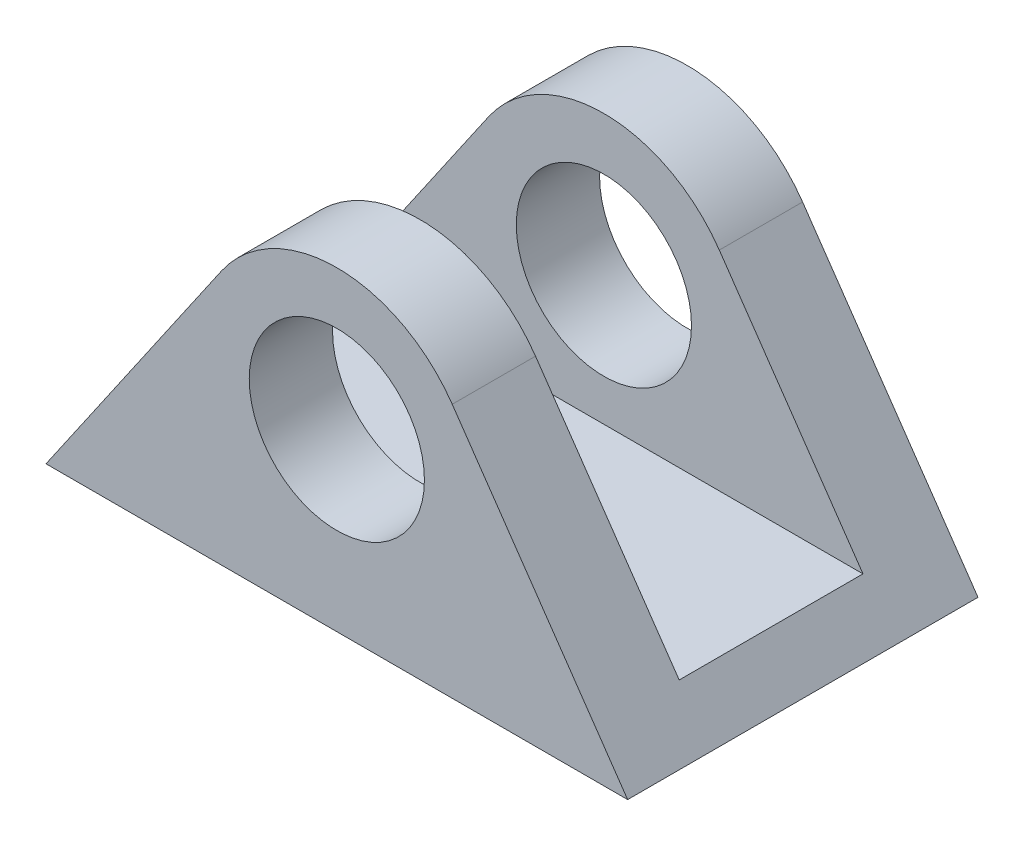
ISO-10303-21;
HEADER;
FILE_DESCRIPTION(('STEP AP214'),'2;1');
FILE_NAME('part.step','',(''),(''),'','','');
FILE_SCHEMA(('AUTOMOTIVE_DESIGN { 1 0 10303 214 1 1 1 1 }'));
ENDSEC;
DATA;
#1=APPLICATION_CONTEXT('core data for automotive mechanical design processes');
#2=APPLICATION_PROTOCOL_DEFINITION('international standard','automotive_design',2000,#1);
#3=PRODUCT_CONTEXT('',#1,'mechanical');
#4=PRODUCT('Part','Part','',(#3));
#5=PRODUCT_RELATED_PRODUCT_CATEGORY('part','',(#4));
#6=PRODUCT_DEFINITION_FORMATION('','',#4);
#7=PRODUCT_DEFINITION_CONTEXT('part definition',#1,'design');
#8=PRODUCT_DEFINITION('design','',#6,#7);
#9=PRODUCT_DEFINITION_SHAPE('','',#8);
#10=(LENGTH_UNIT() NAMED_UNIT(*) SI_UNIT(.MILLI.,.METRE.));
#11=(NAMED_UNIT(*) PLANE_ANGLE_UNIT() SI_UNIT($,.RADIAN.));
#12=(NAMED_UNIT(*) SI_UNIT($,.STERADIAN.) SOLID_ANGLE_UNIT());
#13=UNCERTAINTY_MEASURE_WITH_UNIT(LENGTH_MEASURE(1.E-05),#10,'distance_accuracy_value','');
#14=(GEOMETRIC_REPRESENTATION_CONTEXT(3) GLOBAL_UNCERTAINTY_ASSIGNED_CONTEXT((#13)) GLOBAL_UNIT_ASSIGNED_CONTEXT((#10,
#11,#12)) REPRESENTATION_CONTEXT('',''));
#15=CARTESIAN_POINT('',(0.,0.,0.));
#16=DIRECTION('',(0.,0.,1.));
#17=DIRECTION('',(1.,0.,0.));
#18=AXIS2_PLACEMENT_3D('',#15,#16,#17);
#19=CARTESIAN_POINT('',(0.,0.,20.));
#20=DIRECTION('',(0.,0.,-1.));
#21=DIRECTION('',(-1.,0.,0.));
#22=AXIS2_PLACEMENT_3D('',#19,#20,#21);
#23=CYLINDRICAL_SURFACE('',#22,8.);
#24=DIRECTION('',(0.,0.,-1.));
#25=VECTOR('',#24,1.);
#26=CARTESIAN_POINT('',(-6.58840470910797,4.5379426383554,20.));
#27=LINE('',#26,#25);
#28=CARTESIAN_POINT('',(-6.58840470910797,4.5379426383554,4.75433037321072));
#29=VERTEX_POINT('',#28);
#30=CARTESIAN_POINT('',(-6.58840470910797,4.5379426383554,0.));
#31=VERTEX_POINT('',#30);
#32=EDGE_CURVE('E155',#29,#31,#27,.T.);
#33=ORIENTED_EDGE('',*,*,#32,.F.);
#34=CARTESIAN_POINT('',(0.,0.,4.75433037321072));
#35=DIRECTION('',(0.,0.,-1.));
#36=DIRECTION('',(-1.,0.,0.));
#37=AXIS2_PLACEMENT_3D('',#34,#35,#36);
#38=CIRCLE('',#37,8.);
#39=CARTESIAN_POINT('',(6.58840470910797,4.5379426383554,4.75433037321072));
#40=VERTEX_POINT('',#39);
#41=EDGE_CURVE('E126',#29,#40,#38,.T.);
#42=ORIENTED_EDGE('',*,*,#41,.T.);
#43=DIRECTION('',(0.,0.,-1.));
#44=VECTOR('',#43,1.);
#45=CARTESIAN_POINT('',(6.58840470910797,4.5379426383554,20.));
#46=LINE('',#45,#44);
#47=CARTESIAN_POINT('',(6.58840470910797,4.5379426383554,0.));
#48=VERTEX_POINT('',#47);
#49=EDGE_CURVE('E159',#40,#48,#46,.T.);
#50=ORIENTED_EDGE('',*,*,#49,.T.);
#51=CARTESIAN_POINT('',(0.,0.,0.));
#52=DIRECTION('',(0.,0.,1.));
#53=DIRECTION('',(1.,0.,0.));
#54=AXIS2_PLACEMENT_3D('',#51,#52,#53);
#55=CIRCLE('',#54,8.);
#56=EDGE_CURVE('E124',#48,#31,#55,.T.);
#57=ORIENTED_EDGE('',*,*,#56,.T.);
#58=EDGE_LOOP('',(#33,#42,#50,#57));
#59=FACE_BOUND('',#58,.T.);
#60=ADVANCED_FACE('F34',(#59),#23,.T.);
#61=CARTESIAN_POINT('',(0.,0.,20.));
#62=DIRECTION('',(0.,0.,-1.));
#63=DIRECTION('',(-1.,0.,0.));
#64=AXIS2_PLACEMENT_3D('',#61,#62,#63);
#65=CYLINDRICAL_SURFACE('',#64,5.);
#66=CARTESIAN_POINT('',(0.,0.,4.75433037321072));
#67=DIRECTION('',(0.,0.,-1.));
#68=DIRECTION('',(-1.,0.,0.));
#69=AXIS2_PLACEMENT_3D('',#66,#67,#68);
#70=CIRCLE('',#69,5.);
#71=CARTESIAN_POINT('',(-5.,0.,4.75433037321072));
#72=VERTEX_POINT('',#71);
#73=EDGE_CURVE('E109',#72,#72,#70,.T.);
#74=ORIENTED_EDGE('',*,*,#73,.F.);
#75=EDGE_LOOP('',(#74));
#76=FACE_BOUND('',#75,.T.);
#77=CARTESIAN_POINT('',(0.,0.,0.));
#78=DIRECTION('',(0.,0.,1.));
#79=DIRECTION('',(1.,0.,0.));
#80=AXIS2_PLACEMENT_3D('',#77,#78,#79);
#81=CIRCLE('',#80,5.);
#82=CARTESIAN_POINT('',(5.,0.,0.));
#83=VERTEX_POINT('',#82);
#84=EDGE_CURVE('E133',#83,#83,#81,.T.);
#85=ORIENTED_EDGE('',*,*,#84,.F.);
#86=EDGE_LOOP('',(#85));
#87=FACE_BOUND('',#86,.T.);
#88=ADVANCED_FACE('F197',(#76,#87),#65,.F.);
#89=CARTESIAN_POINT('',(6.58840470910797,4.5379426383554,20.));
#90=DIRECTION('',(0.823550588638496,0.567242829794425,0.));
#91=DIRECTION('',(-0.567242829794425,0.823550588638496,0.));
#92=AXIS2_PLACEMENT_3D('',#89,#90,#91);
#93=PLANE('',#92);
#94=DIRECTION('',(-0.567242829794425,0.823550588638496,0.));
#95=VECTOR('',#94,1.);
#96=CARTESIAN_POINT('',(6.58840470910797,4.5379426383554,4.75433037321072));
#97=LINE('',#96,#95);
#98=CARTESIAN_POINT('',(14.7895999959564,-7.36894952715872,4.75433037321072));
#99=VERTEX_POINT('',#98);
#100=EDGE_CURVE('E121',#99,#40,#97,.T.);
#101=ORIENTED_EDGE('',*,*,#100,.F.);
#102=DIRECTION('',(0.,0.,-1.));
#103=VECTOR('',#102,1.);
#104=CARTESIAN_POINT('',(14.7895999959564,-7.36894952715872,20.));
#105=LINE('',#104,#103);
#106=CARTESIAN_POINT('',(14.7895999959564,-7.36894952715872,15.2456696267893));
#107=VERTEX_POINT('',#106);
#108=EDGE_CURVE('E114',#107,#99,#105,.T.);
#109=ORIENTED_EDGE('',*,*,#108,.F.);
#110=DIRECTION('',(0.567242829794425,-0.823550588638496,0.));
#111=VECTOR('',#110,1.);
#112=CARTESIAN_POINT('',(6.58840470910797,4.5379426383554,15.2456696267893));
#113=LINE('',#112,#111);
#114=CARTESIAN_POINT('',(6.58840470910797,4.5379426383554,15.2456696267893));
#115=VERTEX_POINT('',#114);
#116=EDGE_CURVE('E103',#115,#107,#113,.T.);
#117=ORIENTED_EDGE('',*,*,#116,.F.);
#118=CARTESIAN_POINT('',(6.58840470910797,4.5379426383554,20.));
#119=VERTEX_POINT('',#118);
#120=EDGE_CURVE('E42',#119,#115,#46,.T.);
#121=ORIENTED_EDGE('',*,*,#120,.F.);
#122=DIRECTION('',(0.567242829794425,-0.823550588638496,0.));
#123=VECTOR('',#122,1.);
#124=CARTESIAN_POINT('',(6.58840470910797,4.5379426383554,20.));
#125=LINE('',#124,#123);
#126=CARTESIAN_POINT('',(16.601807450041,-10.,20.));
#127=VERTEX_POINT('',#126);
#128=EDGE_CURVE('E130',#119,#127,#125,.T.);
#129=ORIENTED_EDGE('',*,*,#128,.T.);
#130=DIRECTION('',(0.,0.,-1.));
#131=VECTOR('',#130,1.);
#132=CARTESIAN_POINT('',(16.601807450041,-10.,20.));
#133=LINE('',#132,#131);
#134=CARTESIAN_POINT('',(16.601807450041,-10.,0.));
#135=VERTEX_POINT('',#134);
#136=EDGE_CURVE('E58',#127,#135,#133,.T.);
#137=ORIENTED_EDGE('',*,*,#136,.T.);
#138=DIRECTION('',(0.567242829794425,-0.823550588638496,0.));
#139=VECTOR('',#138,1.);
#140=CARTESIAN_POINT('',(6.58840470910797,4.5379426383554,0.));
#141=LINE('',#140,#139);
#142=EDGE_CURVE('E122',#48,#135,#141,.T.);
#143=ORIENTED_EDGE('',*,*,#142,.F.);
#144=ORIENTED_EDGE('',*,*,#49,.F.);
#145=EDGE_LOOP('',(#101,#109,#117,#121,#129,#137,#143,#144));
#146=FACE_BOUND('',#145,.T.);
#147=ADVANCED_FACE('F36',(#146),#93,.T.);
#148=ORIENTED_EDGE('',*,*,#120,.T.);
#149=CARTESIAN_POINT('',(0.,0.,15.2456696267893));
#150=DIRECTION('',(0.,0.,1.));
#151=DIRECTION('',(1.,0.,0.));
#152=AXIS2_PLACEMENT_3D('',#149,#150,#151);
#153=CIRCLE('',#152,8.);
#154=CARTESIAN_POINT('',(-6.58840470910797,4.5379426383554,15.2456696267893));
#155=VERTEX_POINT('',#154);
#156=EDGE_CURVE('E107',#115,#155,#153,.T.);
#157=ORIENTED_EDGE('',*,*,#156,.T.);
#158=CARTESIAN_POINT('',(-6.58840470910797,4.5379426383554,20.));
#159=VERTEX_POINT('',#158);
#160=EDGE_CURVE('E156',#159,#155,#27,.T.);
#161=ORIENTED_EDGE('',*,*,#160,.F.);
#162=CARTESIAN_POINT('',(0.,0.,20.));
#163=DIRECTION('',(0.,0.,1.));
#164=DIRECTION('',(1.,0.,0.));
#165=AXIS2_PLACEMENT_3D('',#162,#163,#164);
#166=CIRCLE('',#165,8.);
#167=EDGE_CURVE('E132',#119,#159,#166,.T.);
#168=ORIENTED_EDGE('',*,*,#167,.F.);
#169=EDGE_LOOP('',(#148,#157,#161,#168));
#170=FACE_BOUND('',#169,.T.);
#171=ADVANCED_FACE('F182',(#170),#23,.T.);
#172=CARTESIAN_POINT('',(-6.58840470910797,4.5379426383554,20.));
#173=DIRECTION('',(0.823550588638496,-0.567242829794425,0.));
#174=DIRECTION('',(0.567242829794425,0.823550588638496,0.));
#175=AXIS2_PLACEMENT_3D('',#172,#173,#174);
#176=PLANE('',#175);
#177=DIRECTION('',(0.,0.,-1.));
#178=VECTOR('',#177,1.);
#179=CARTESIAN_POINT('',(-14.7895999959564,-7.36894952715872,20.));
#180=LINE('',#179,#178);
#181=CARTESIAN_POINT('',(-14.7895999959564,-7.36894952715872,15.2456696267893));
#182=VERTEX_POINT('',#181);
#183=CARTESIAN_POINT('',(-14.7895999959564,-7.36894952715872,4.75433037321072));
#184=VERTEX_POINT('',#183);
#185=EDGE_CURVE('E11',#182,#184,#180,.T.);
#186=ORIENTED_EDGE('',*,*,#185,.T.);
#187=DIRECTION('',(0.567242829794425,0.823550588638496,0.));
#188=VECTOR('',#187,1.);
#189=CARTESIAN_POINT('',(-6.58840470910797,4.5379426383554,4.75433037321072));
#190=LINE('',#189,#188);
#191=EDGE_CURVE('E165',#184,#29,#190,.T.);
#192=ORIENTED_EDGE('',*,*,#191,.T.);
#193=ORIENTED_EDGE('',*,*,#32,.T.);
#194=DIRECTION('',(-0.567242829794425,-0.823550588638496,0.));
#195=VECTOR('',#194,1.);
#196=CARTESIAN_POINT('',(-6.58840470910797,4.5379426383554,0.));
#197=LINE('',#196,#195);
#198=CARTESIAN_POINT('',(-16.601807450041,-10.,0.));
#199=VERTEX_POINT('',#198);
#200=EDGE_CURVE('E144',#31,#199,#197,.T.);
#201=ORIENTED_EDGE('',*,*,#200,.T.);
#202=DIRECTION('',(0.,0.,-1.));
#203=VECTOR('',#202,1.);
#204=CARTESIAN_POINT('',(-16.601807450041,-10.,20.));
#205=LINE('',#204,#203);
#206=CARTESIAN_POINT('',(-16.601807450041,-10.,20.));
#207=VERTEX_POINT('',#206);
#208=EDGE_CURVE('E153',#207,#199,#205,.T.);
#209=ORIENTED_EDGE('',*,*,#208,.F.);
#210=DIRECTION('',(-0.567242829794425,-0.823550588638496,0.));
#211=VECTOR('',#210,1.);
#212=CARTESIAN_POINT('',(-6.58840470910797,4.5379426383554,20.));
#213=LINE('',#212,#211);
#214=EDGE_CURVE('E135',#159,#207,#213,.T.);
#215=ORIENTED_EDGE('',*,*,#214,.F.);
#216=ORIENTED_EDGE('',*,*,#160,.T.);
#217=DIRECTION('',(-0.567242829794425,-0.823550588638496,0.));
#218=VECTOR('',#217,1.);
#219=CARTESIAN_POINT('',(-6.58840470910797,4.5379426383554,15.2456696267893));
#220=LINE('',#219,#218);
#221=EDGE_CURVE('E163',#155,#182,#220,.T.);
#222=ORIENTED_EDGE('',*,*,#221,.T.);
#223=EDGE_LOOP('',(#186,#192,#193,#201,#209,#215,#216,#222));
#224=FACE_BOUND('',#223,.T.);
#225=ADVANCED_FACE('F178',(#224),#176,.F.);
#226=CARTESIAN_POINT('',(0.,-10.,20.));
#227=DIRECTION('',(0.,-1.,0.));
#228=DIRECTION('',(1.,0.,0.));
#229=AXIS2_PLACEMENT_3D('',#226,#227,#228);
#230=PLANE('',#229);
#231=DIRECTION('',(-1.,0.,0.));
#232=VECTOR('',#231,1.);
#233=CARTESIAN_POINT('',(0.,-10.,0.));
#234=LINE('',#233,#232);
#235=EDGE_CURVE('E147',#135,#199,#234,.T.);
#236=ORIENTED_EDGE('',*,*,#235,.F.);
#237=ORIENTED_EDGE('',*,*,#136,.F.);
#238=DIRECTION('',(-1.,0.,0.));
#239=VECTOR('',#238,1.);
#240=CARTESIAN_POINT('',(0.,-10.,20.));
#241=LINE('',#240,#239);
#242=EDGE_CURVE('E137',#127,#207,#241,.T.);
#243=ORIENTED_EDGE('',*,*,#242,.T.);
#244=ORIENTED_EDGE('',*,*,#208,.T.);
#245=EDGE_LOOP('',(#236,#237,#243,#244));
#246=FACE_BOUND('',#245,.T.);
#247=ADVANCED_FACE('F189',(#246),#230,.T.);
#248=CARTESIAN_POINT('',(0.,0.,15.2456696267893));
#249=DIRECTION('',(0.,0.,1.));
#250=DIRECTION('',(1.,0.,0.));
#251=AXIS2_PLACEMENT_3D('',#248,#249,#250);
#252=CIRCLE('',#251,5.);
#253=CARTESIAN_POINT('',(5.,0.,15.2456696267893));
#254=VERTEX_POINT('',#253);
#255=EDGE_CURVE('E161',#254,#254,#252,.T.);
#256=ORIENTED_EDGE('',*,*,#255,.F.);
#257=EDGE_LOOP('',(#256));
#258=FACE_BOUND('',#257,.T.);
#259=CARTESIAN_POINT('',(0.,0.,20.));
#260=DIRECTION('',(0.,0.,1.));
#261=DIRECTION('',(1.,0.,0.));
#262=AXIS2_PLACEMENT_3D('',#259,#260,#261);
#263=CIRCLE('',#262,5.);
#264=CARTESIAN_POINT('',(5.,0.,20.));
#265=VERTEX_POINT('',#264);
#266=EDGE_CURVE('E139',#265,#265,#263,.T.);
#267=ORIENTED_EDGE('',*,*,#266,.T.);
#268=EDGE_LOOP('',(#267));
#269=FACE_BOUND('',#268,.T.);
#270=ADVANCED_FACE('F203',(#258,#269),#65,.F.);
#271=CARTESIAN_POINT('',(0.,0.,20.));
#272=DIRECTION('',(0.,0.,1.));
#273=DIRECTION('',(1.,0.,0.));
#274=AXIS2_PLACEMENT_3D('',#271,#272,#273);
#275=PLANE('',#274);
#276=ORIENTED_EDGE('',*,*,#128,.F.);
#277=ORIENTED_EDGE('',*,*,#167,.T.);
#278=ORIENTED_EDGE('',*,*,#214,.T.);
#279=ORIENTED_EDGE('',*,*,#242,.F.);
#280=EDGE_LOOP('',(#276,#277,#278,#279));
#281=FACE_BOUND('',#280,.T.);
#282=ORIENTED_EDGE('',*,*,#266,.F.);
#283=EDGE_LOOP('',(#282));
#284=FACE_BOUND('',#283,.T.);
#285=ADVANCED_FACE('F186',(#281,#284),#275,.T.);
#286=CARTESIAN_POINT('',(0.,0.,0.));
#287=DIRECTION('',(0.,0.,1.));
#288=DIRECTION('',(1.,0.,0.));
#289=AXIS2_PLACEMENT_3D('',#286,#287,#288);
#290=PLANE('',#289);
#291=ORIENTED_EDGE('',*,*,#142,.T.);
#292=ORIENTED_EDGE('',*,*,#235,.T.);
#293=ORIENTED_EDGE('',*,*,#200,.F.);
#294=ORIENTED_EDGE('',*,*,#56,.F.);
#295=EDGE_LOOP('',(#291,#292,#293,#294));
#296=FACE_BOUND('',#295,.T.);
#297=ORIENTED_EDGE('',*,*,#84,.T.);
#298=EDGE_LOOP('',(#297));
#299=FACE_BOUND('',#298,.T.);
#300=ADVANCED_FACE('F193',(#296,#299),#290,.F.);
#301=CARTESIAN_POINT('',(-16.601807450041,-7.36894952715872,15.2456696267893));
#302=DIRECTION('',(0.,-1.,0.));
#303=DIRECTION('',(0.,0.,-1.));
#304=AXIS2_PLACEMENT_3D('',#301,#302,#303);
#305=PLANE('',#304);
#306=ORIENTED_EDGE('',*,*,#108,.T.);
#307=DIRECTION('',(1.,0.,0.));
#308=VECTOR('',#307,1.);
#309=CARTESIAN_POINT('',(-16.601807450041,-7.36894952715872,4.75433037321072));
#310=LINE('',#309,#308);
#311=EDGE_CURVE('E117',#184,#99,#310,.T.);
#312=ORIENTED_EDGE('',*,*,#311,.F.);
#313=ORIENTED_EDGE('',*,*,#185,.F.);
#314=DIRECTION('',(1.,0.,0.));
#315=VECTOR('',#314,1.);
#316=CARTESIAN_POINT('',(-16.601807450041,-7.36894952715872,15.2456696267893));
#317=LINE('',#316,#315);
#318=EDGE_CURVE('E49',#182,#107,#317,.T.);
#319=ORIENTED_EDGE('',*,*,#318,.T.);
#320=EDGE_LOOP('',(#306,#312,#313,#319));
#321=FACE_BOUND('',#320,.T.);
#322=ADVANCED_FACE('F112',(#321),#305,.F.);
#323=CARTESIAN_POINT('',(-16.601807450041,11.9220774205029,4.75433037321072));
#324=DIRECTION('',(0.,0.,-1.));
#325=DIRECTION('',(-1.,0.,0.));
#326=AXIS2_PLACEMENT_3D('',#323,#324,#325);
#327=PLANE('',#326);
#328=ORIENTED_EDGE('',*,*,#100,.T.);
#329=ORIENTED_EDGE('',*,*,#41,.F.);
#330=ORIENTED_EDGE('',*,*,#191,.F.);
#331=ORIENTED_EDGE('',*,*,#311,.T.);
#332=EDGE_LOOP('',(#328,#329,#330,#331));
#333=FACE_BOUND('',#332,.T.);
#334=ORIENTED_EDGE('',*,*,#73,.T.);
#335=EDGE_LOOP('',(#334));
#336=FACE_BOUND('',#335,.T.);
#337=ADVANCED_FACE('F177',(#333,#336),#327,.F.);
#338=CARTESIAN_POINT('',(-16.601807450041,11.9220774205029,15.2456696267893));
#339=DIRECTION('',(0.,0.,1.));
#340=DIRECTION('',(1.,0.,0.));
#341=AXIS2_PLACEMENT_3D('',#338,#339,#340);
#342=PLANE('',#341);
#343=ORIENTED_EDGE('',*,*,#116,.T.);
#344=ORIENTED_EDGE('',*,*,#318,.F.);
#345=ORIENTED_EDGE('',*,*,#221,.F.);
#346=ORIENTED_EDGE('',*,*,#156,.F.);
#347=EDGE_LOOP('',(#343,#344,#345,#346));
#348=FACE_BOUND('',#347,.T.);
#349=ORIENTED_EDGE('',*,*,#255,.T.);
#350=EDGE_LOOP('',(#349));
#351=FACE_BOUND('',#350,.T.);
#352=ADVANCED_FACE('F104',(#348,#351),#342,.F.);
#353=CLOSED_SHELL('',(#60,#88,#147,#171,#225,#247,#270,#285,#300,#322,#337,#352));
#354=MANIFOLD_SOLID_BREP('B2',#353);
#355=ADVANCED_BREP_SHAPE_REPRESENTATION('',(#18,#354),#14);
#356=SHAPE_DEFINITION_REPRESENTATION(#9,#355);
ENDSEC;
END-ISO-10303-21;
